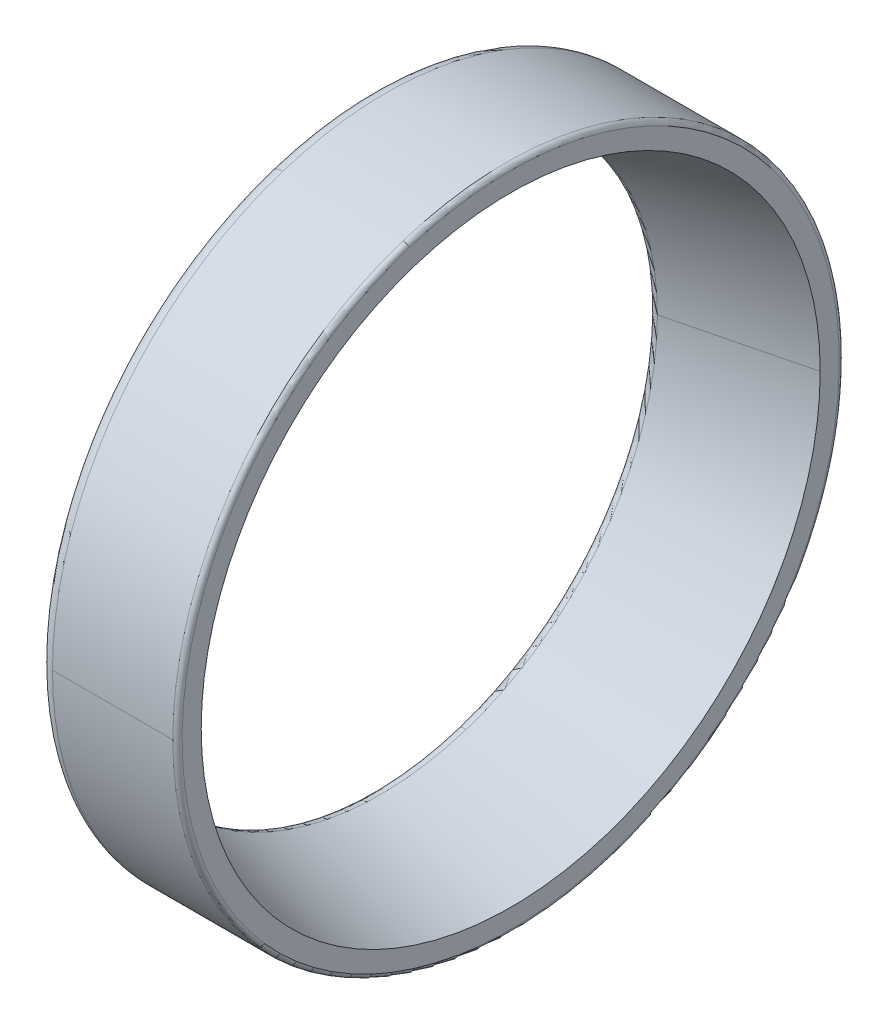
ISO-10303-21;
HEADER;
FILE_DESCRIPTION(('STEP AP214'),'2;1');
FILE_NAME('part.step','',(''),(''),'','','');
FILE_SCHEMA(('AUTOMOTIVE_DESIGN { 1 0 10303 214 1 1 1 1 }'));
ENDSEC;
DATA;
#1=APPLICATION_CONTEXT('core data for automotive mechanical design processes');
#2=APPLICATION_PROTOCOL_DEFINITION('international standard','automotive_design',2000,#1);
#3=PRODUCT_CONTEXT('',#1,'mechanical');
#4=PRODUCT('Part','Part','',(#3));
#5=PRODUCT_RELATED_PRODUCT_CATEGORY('part','',(#4));
#6=PRODUCT_DEFINITION_FORMATION('','',#4);
#7=PRODUCT_DEFINITION_CONTEXT('part definition',#1,'design');
#8=PRODUCT_DEFINITION('design','',#6,#7);
#9=PRODUCT_DEFINITION_SHAPE('','',#8);
#10=(LENGTH_UNIT() NAMED_UNIT(*) SI_UNIT(.MILLI.,.METRE.));
#11=(NAMED_UNIT(*) PLANE_ANGLE_UNIT() SI_UNIT($,.RADIAN.));
#12=(NAMED_UNIT(*) SI_UNIT($,.STERADIAN.) SOLID_ANGLE_UNIT());
#13=UNCERTAINTY_MEASURE_WITH_UNIT(LENGTH_MEASURE(1.E-05),#10,'distance_accuracy_value','');
#14=(GEOMETRIC_REPRESENTATION_CONTEXT(3) GLOBAL_UNCERTAINTY_ASSIGNED_CONTEXT((#13)) GLOBAL_UNIT_ASSIGNED_CONTEXT((#10,
#11,#12)) REPRESENTATION_CONTEXT('',''));
#15=CARTESIAN_POINT('',(0.,0.,0.));
#16=DIRECTION('',(0.,0.,1.));
#17=DIRECTION('',(1.,0.,0.));
#18=AXIS2_PLACEMENT_3D('',#15,#16,#17);
#19=CARTESIAN_POINT('',(0.,34.5,0.));
#20=DIRECTION('',(-1.,0.,0.));
#21=DIRECTION('',(0.,0.,1.));
#22=AXIS2_PLACEMENT_3D('',#19,#20,#21);
#23=PLANE('',#22);
#24=CARTESIAN_POINT('',(0.,0.,0.));
#25=DIRECTION('',(1.,0.,0.));
#26=DIRECTION('',(0.,0.,-1.));
#27=AXIS2_PLACEMENT_3D('',#24,#25,#26);
#28=CIRCLE('',#27,30.64260080616);
#29=CARTESIAN_POINT('',(0.,29.1428451729286,9.46908440095059));
#30=VERTEX_POINT('',#29);
#31=CARTESIAN_POINT('',(0.,-29.1428451729286,-9.46908440095059));
#32=VERTEX_POINT('',#31);
#33=EDGE_CURVE('E11',#30,#32,#28,.T.);
#34=ORIENTED_EDGE('',*,*,#33,.T.);
#35=CARTESIAN_POINT('',(0.,-29.1428451729296,-9.4690844009509));
#36=CARTESIAN_POINT('',(0.,-27.6553844609523,-14.0467889832671));
#37=CARTESIAN_POINT('',(0.,-25.2694637617286,-18.3327089530953));
#38=CARTESIAN_POINT('',(0.,-22.05991163477,-22.0904091483767));
#39=CARTESIAN_POINT('',(0.,-14.3404293681213,-28.1446665935469));
#40=CARTESIAN_POINT('',(0.,-4.9050282422195,-30.8312866100828));
#41=CARTESIAN_POINT('',(0.,0.0215661764424724,-31.2190264007923));
#42=CARTESIAN_POINT('',(0.,9.76106776064583,-30.0414775521919));
#43=CARTESIAN_POINT('',(0.,18.3326359060695,-25.2693991865423));
#44=CARTESIAN_POINT('',(0.,22.0904267844536,-22.059931563147));
#45=CARTESIAN_POINT('',(0.,28.1446710198193,-14.3404206810727));
#46=CARTESIAN_POINT('',(0.,30.831260121461,-4.90502568793965));
#47=CARTESIAN_POINT('',(0.,31.21912157918,0.0215450364993295));
#48=CARTESIAN_POINT('',(0.,30.630171421312,4.89133612876434));
#49=CARTESIAN_POINT('',(0.,29.1428451729296,9.46908440095089));
#50=B_SPLINE_CURVE_WITH_KNOTS('',5,(#35,#36,#37,#38,#39,#40,#41,#42,#43,#44,#45,#46,#47,#48,
#49),.UNSPECIFIED.,.F.,.F.,(6,3,3,3,6),(0.,0.785398163397448,1.5707963267949,2.35619449019234,
3.14159265358979),.UNSPECIFIED.);
#51=EDGE_CURVE('E25',#32,#30,#50,.T.);
#52=ORIENTED_EDGE('',*,*,#51,.T.);
#53=EDGE_LOOP('',(#34,#52));
#54=FACE_BOUND('',#53,.T.);
#55=CARTESIAN_POINT('',(0.,32.8114498121828,10.6610863059358));
#56=CARTESIAN_POINT('',(0.,32.6370194077504,11.1979666405393));
#57=CARTESIAN_POINT('',(0.,32.4493900248656,11.7305572957197));
#58=CARTESIAN_POINT('',(0.,32.0482345212866,12.7858948926291));
#59=CARTESIAN_POINT('',(0.,31.8347084005924,13.308641834358));
#60=CARTESIAN_POINT('',(0.,31.3822606404899,14.3430276497588));
#61=CARTESIAN_POINT('',(0.,31.1433390010817,14.8546665234307));
#62=CARTESIAN_POINT('',(0.,30.6406793193583,15.8656049626667));
#63=CARTESIAN_POINT('',(0.,30.3769412770432,16.3649045282308));
#64=CARTESIAN_POINT('',(0.,29.8252832109797,17.3499611350593));
#65=CARTESIAN_POINT('',(0.,29.5373631872314,17.8357181763237));
#66=CARTESIAN_POINT('',(0.,28.9380350364906,18.7925195997026));
#67=CARTESIAN_POINT('',(0.,28.6266269094981,19.2635639818171));
#68=CARTESIAN_POINT('',(0.,27.9810726937622,20.1898052738883));
#69=CARTESIAN_POINT('',(0.,27.6469266050188,20.6450021838449));
#70=CARTESIAN_POINT('',(0.,26.9567014711866,21.5384519292956));
#71=CARTESIAN_POINT('',(0.,26.6006224260979,21.9767047647896));
#72=CARTESIAN_POINT('',(0.,25.8673892003041,22.8352105699932));
#73=CARTESIAN_POINT('',(0.,25.4902350195991,23.2554635397028));
#74=CARTESIAN_POINT('',(0.,24.7157601213364,24.0769571876206));
#75=CARTESIAN_POINT('',(0.,24.3184394037787,24.4781978658289));
#76=CARTESIAN_POINT('',(0.,23.5045886118701,25.2607003066726));
#77=CARTESIAN_POINT('',(0.,23.0880585375191,25.6419620693081));
#78=CARTESIAN_POINT('',(0.,22.2367924895506,26.3835881860611));
#79=CARTESIAN_POINT('',(0.,21.8020565159331,26.7439525401786));
#80=CARTESIAN_POINT('',(0.,20.9154259864453,27.4429156905929));
#81=CARTESIAN_POINT('',(0.,20.4635314305749,27.7815144868897));
#82=CARTESIAN_POINT('',(0.,19.5436723901544,28.4361308075071));
#83=CARTESIAN_POINT('',(0.,19.0757079056043,28.7521483318277));
#84=CARTESIAN_POINT('',(0.,18.1248363752546,29.3608407945961));
#85=CARTESIAN_POINT('',(0.,17.641929329455,29.6535157330439));
#86=CARTESIAN_POINT('',(0.,16.662336041978,30.2148179445047));
#87=CARTESIAN_POINT('',(0.,16.1656498003005,30.4834452175178));
#88=CARTESIAN_POINT('',(0.,15.1596946817281,30.9960049514796));
#89=CARTESIAN_POINT('',(0.,14.6504258048333,31.2399374124283));
#90=CARTESIAN_POINT('',(0.,13.6205322891575,31.702519867597));
#91=CARTESIAN_POINT('',(0.,13.0999076503766,31.9211698618169));
#92=CARTESIAN_POINT('',(0.,12.0485568412846,32.3326606365405));
#93=CARTESIAN_POINT('',(0.,11.5178306709737,32.5255014170442));
#94=CARTESIAN_POINT('',(0.,10.4475553646521,32.8849091940041));
#95=CARTESIAN_POINT('',(0.,9.90800622864158,33.0514761904603));
#96=CARTESIAN_POINT('',(0.,8.82138481204843,33.3579351248414));
#97=CARTESIAN_POINT('',(0.,8.27431253146584,33.4978270627662));
#98=CARTESIAN_POINT('',(0.,7.17396277077043,33.7505988681529));
#99=CARTESIAN_POINT('',(0.,6.62068529065761,33.8634787356148));
#100=CARTESIAN_POINT('',(0.,5.50925802481272,34.0619544625878));
#101=CARTESIAN_POINT('',(0.,4.95110823908065,34.1475503220988));
#102=CARTESIAN_POINT('',(0.,3.83128099371924,34.2912518252474));
#103=CARTESIAN_POINT('',(0.,3.26960353408989,34.3493574688848));
#104=CARTESIAN_POINT('',(0.,2.1440740711313,34.437938558701));
#105=CARTESIAN_POINT('',(0.,1.58022206780205,34.4684140048798));
#106=CARTESIAN_POINT('',(0.,0.451701886307285,34.5016612817596));
#107=CARTESIAN_POINT('',(0.,-0.112966291858231,34.5044331124606));
#108=CARTESIAN_POINT('',(0.,-1.24175848792524,34.4822664808019));
#109=CARTESIAN_POINT('',(0.,-1.80588250582674,34.4573280184421));
#110=CARTESIAN_POINT('',(0.,-2.93222735719516,34.379800879602));
#111=CARTESIAN_POINT('',(0.,-3.49444819066209,34.3272122031217));
#112=CARTESIAN_POINT('',(0.,-4.61563223392882,34.1945113267683));
#113=CARTESIAN_POINT('',(0.,-5.17459544372863,34.1143991268952));
#114=CARTESIAN_POINT('',(0.,-6.28791764832931,33.9268442010629));
#115=CARTESIAN_POINT('',(0.,-6.84227664313019,33.8194014751036));
#116=CARTESIAN_POINT('',(0.,-7.94505491835844,33.5774443360366));
#117=CARTESIAN_POINT('',(0.,-8.4934741987858,33.4429299229288));
#118=CARTESIAN_POINT('',(0.,-9.58305185518461,33.147153466568));
#119=CARTESIAN_POINT('',(0.,-10.1242102311561,32.9858914233149));
#120=CARTESIAN_POINT('',(0.,-11.1979623807154,32.6370082010506));
#121=CARTESIAN_POINT('',(0.,-11.7305561543034,32.4493870220394));
#122=CARTESIAN_POINT('',(0.,-12.7858960340455,32.0482375241127));
#123=CARTESIAN_POINT('',(0.,-13.3086421401996,31.8347092051972));
#124=CARTESIAN_POINT('',(0.,-14.3430273439172,31.3822598358851));
#125=CARTESIAN_POINT('',(0.,-14.8546664414807,31.1433387854885));
#126=CARTESIAN_POINT('',(0.,-15.8656050446167,30.6406795349516));
#127=CARTESIAN_POINT('',(0.,-16.3649045501892,30.3769413348112));
#128=CARTESIAN_POINT('',(0.,-17.3499611131008,29.8252831532117));
#129=CARTESIAN_POINT('',(0.,-17.8357181704399,29.5373631717526));
#130=CARTESIAN_POINT('',(0.,-18.7925196055863,28.9380350519696));
#131=CARTESIAN_POINT('',(0.,-19.2635639833936,28.6266269136457));
#132=CARTESIAN_POINT('',(0.,-20.1898052723117,27.9810726896147));
#133=CARTESIAN_POINT('',(0.,-20.6450021834224,27.6469266039075));
#134=CARTESIAN_POINT('',(0.,-21.538451929718,26.956701472298));
#135=CARTESIAN_POINT('',(0.,-21.9767047649028,26.6006224263957));
#136=CARTESIAN_POINT('',(0.,-22.83521056988,25.8673892000064));
#137=CARTESIAN_POINT('',(0.,-23.2554635396724,25.4902350195194));
#138=CARTESIAN_POINT('',(0.,-24.0769571876509,24.7157601214162));
#139=CARTESIAN_POINT('',(0.,-24.478197865837,24.3184394038001));
#140=CARTESIAN_POINT('',(0.,-25.2607003066645,23.5045886118487));
#141=CARTESIAN_POINT('',(0.,-25.6419620693059,23.0880585375134));
#142=CARTESIAN_POINT('',(0.,-26.3835881860632,22.2367924895564));
#143=CARTESIAN_POINT('',(0.,-26.7439525401791,21.8020565159347));
#144=CARTESIAN_POINT('',(0.,-27.4429156905923,20.9154259864438));
#145=CARTESIAN_POINT('',(0.,-27.7815144868896,20.4635314305745));
#146=CARTESIAN_POINT('',(0.,-28.4361308075073,19.5436723901549));
#147=CARTESIAN_POINT('',(0.,-28.7521483318278,19.0757079056044));
#148=CARTESIAN_POINT('',(0.,-29.3608407945961,18.1248363752545));
#149=CARTESIAN_POINT('',(0.,-29.6535157330438,17.6419293294551));
#150=CARTESIAN_POINT('',(0.,-30.2148179445047,16.6623360419781));
#151=CARTESIAN_POINT('',(0.,-30.4834452175178,16.1656498003005));
#152=CARTESIAN_POINT('',(0.,-30.9960049514796,15.1596946817282));
#153=CARTESIAN_POINT('',(0.,-31.2399374124283,14.6504258048334));
#154=CARTESIAN_POINT('',(0.,-31.702519867597,13.6205322891576));
#155=CARTESIAN_POINT('',(0.,-31.9211698618171,13.0999076503766));
#156=CARTESIAN_POINT('',(0.,-32.3326606365404,12.0485568412847));
#157=CARTESIAN_POINT('',(0.,-32.5255014170437,11.5178306709738));
#158=CARTESIAN_POINT('',(0.,-32.8849091940045,10.4475553646521));
#159=CARTESIAN_POINT('',(0.,-33.0514761904619,9.90800622864118));
#160=CARTESIAN_POINT('',(0.,-33.3579351248398,8.82138481204889));
#161=CARTESIAN_POINT('',(0.,-33.4978270627603,8.27431253146748));
#162=CARTESIAN_POINT('',(0.,-33.7505988681588,7.17396277076887));
#163=CARTESIAN_POINT('',(0.,-33.8634787356369,6.62068529065166));
#164=CARTESIAN_POINT('',(0.,-34.0619544625657,5.50925802481875));
#165=CARTESIAN_POINT('',(0.,-34.1475503220165,4.95110823910304));
#166=CARTESIAN_POINT('',(0.,-34.2912518253298,3.83128099369689));
#167=CARTESIAN_POINT('',(0.,-34.3493574691922,3.26960353400645));
#168=CARTESIAN_POINT('',(0.,-34.4379385583936,2.14407407121478));
#169=CARTESIAN_POINT('',(0.,-34.4684140037325,1.58022206811355));
#170=CARTESIAN_POINT('',(0.,-34.501661282907,0.451701885995848));
#171=CARTESIAN_POINT('',(0.,-34.5044331167427,-0.112966293020619));
#172=CARTESIAN_POINT('',(0.,-34.4822664765197,-1.24175848676279));
#173=CARTESIAN_POINT('',(0.,-34.457328002461,-1.80588250148849));
#174=CARTESIAN_POINT('',(0.,-34.3798008955831,-2.93222736153335));
#175=CARTESIAN_POINT('',(0.,-34.3272122627638,-3.49444820685252));
#176=CARTESIAN_POINT('',(0.,-34.1945112671261,-4.61563221773836));
#177=CARTESIAN_POINT('',(0.,-34.1143989043076,-5.17459538330505));
#178=CARTESIAN_POINT('',(0.,-33.9268444236505,-6.28791770875285));
#179=CARTESIAN_POINT('',(0.,-33.8194023058118,-6.84227686863398));
#180=CARTESIAN_POINT('',(0.,-33.5774435053284,-7.94505469285459));
#181=CARTESIAN_POINT('',(0.,-33.4429268226837,-8.49347335719408));
#182=CARTESIAN_POINT('',(0.,-33.147156566813,-9.58305269677627));
#183=CARTESIAN_POINT('',(0.,-32.9859029935871,-10.124213372019));
#184=CARTESIAN_POINT('',(0.,-32.8114498121828,-10.6610863059357));
#185=B_SPLINE_CURVE_WITH_KNOTS('',3,(#55,#56,#57,#58,#59,#60,#61,#62,#63,#64,#65,#66,#67,#68,
#69,#70,#71,#72,#73,#74,#75,#76,#77,#78,#79,#80,#81,#82,#83,#84,#85,#86,#87,#88,#89,#90,#91,#92,
#93,#94,#95,#96,#97,#98,#99,#100,#101,#102,#103,#104,#105,#106,#107,#108,#109,#110,#111,#112,
#113,#114,#115,#116,#117,#118,#119,#120,#121,#122,#123,#124,#125,#126,#127,#128,#129,#130,#131,
#132,#133,#134,#135,#136,#137,#138,#139,#140,#141,#142,#143,#144,#145,#146,#147,#148,#149,#150,
#151,#152,#153,#154,#155,#156,#157,#158,#159,#160,#161,#162,#163,#164,#165,#166,#167,#168,#169,
#170,#171,#172,#173,#174,#175,#176,#177,#178,#179,#180,#181,#182,#183,#184),.UNSPECIFIED.,.F.,
.F.,(4,2,2,2,2,2,2,2,2,2,2,2,2,2,2,2,2,2,2,2,2,2,2,2,2,2,2,2,2,2,2,2,2,2,2,2,2,2,2,2,2,2,2,2,2,
2,2,2,2,2,2,2,2,2,2,2,2,2,2,2,2,2,2,2,4),(0.,1.69334476808094,3.38668953616189,5.08003430424284,
6.77337907232379,8.46672384040474,10.1600686084857,11.8534133765666,13.5467581446476,
15.2401029127285,16.9334476808095,18.6267924488904,20.3201372169714,22.0134819850523,
23.7068267531333,25.4001715212142,27.0935162892952,28.7868610573761,30.4802058254571,
32.173550593538,33.8668953616189,35.5602401296999,37.2535848977808,38.9469296658618,
40.6402744339427,42.3336192020237,44.0269639701046,45.7203087381856,47.4136535062665,
49.1069982743475,50.8003430424284,52.4936878105094,54.1870325785903,55.8803773466713,
57.5737221147522,59.2670668828332,60.9604116509141,62.6537564189951,64.347101187076,
66.040445955157,67.7337907232379,69.4271354913189,71.1204802593998,72.8138250274808,
74.5071697955617,76.2005145636427,77.8938593317236,79.5872040998046,81.2805488678855,
82.9738936359664,84.6672384040474,86.3605831721283,88.0539279402093,89.7472727082902,
91.4406174763712,93.1339622444521,94.8273070125331,96.520651780614,98.213996548695,
99.9073413167759,101.600686084857,103.294030852938,104.987375621019,106.6807203891,
108.374065157181),.UNSPECIFIED.);
#186=CARTESIAN_POINT('',(0.,32.8114498121828,10.6610863059357));
#187=VERTEX_POINT('',#186);
#188=CARTESIAN_POINT('',(0.,-32.8114498121828,-10.6610863059357));
#189=VERTEX_POINT('',#188);
#190=EDGE_CURVE('E199',#187,#189,#185,.T.);
#191=ORIENTED_EDGE('',*,*,#190,.F.);
#192=CARTESIAN_POINT('',(0.,-32.8114498121828,-10.6610863059358));
#193=CARTESIAN_POINT('',(0.,-32.6370194077504,-11.1979666405393));
#194=CARTESIAN_POINT('',(0.,-32.4493900248656,-11.7305572957197));
#195=CARTESIAN_POINT('',(0.,-32.0482345212866,-12.7858948926291));
#196=CARTESIAN_POINT('',(0.,-31.8347084005924,-13.308641834358));
#197=CARTESIAN_POINT('',(0.,-31.3822606404899,-14.3430276497588));
#198=CARTESIAN_POINT('',(0.,-31.1433390010817,-14.8546665234307));
#199=CARTESIAN_POINT('',(0.,-30.6406793193583,-15.8656049626667));
#200=CARTESIAN_POINT('',(0.,-30.3769412770432,-16.3649045282308));
#201=CARTESIAN_POINT('',(0.,-29.8252832109797,-17.3499611350593));
#202=CARTESIAN_POINT('',(0.,-29.5373631872315,-17.8357181763237));
#203=CARTESIAN_POINT('',(0.,-28.9380350364906,-18.7925195997026));
#204=CARTESIAN_POINT('',(0.,-28.6266269094981,-19.2635639818171));
#205=CARTESIAN_POINT('',(0.,-27.9810726937622,-20.1898052738883));
#206=CARTESIAN_POINT('',(0.,-27.6469266050188,-20.6450021838449));
#207=CARTESIAN_POINT('',(0.,-26.9567014711867,-21.5384519292956));
#208=CARTESIAN_POINT('',(0.,-26.6006224260979,-21.9767047647896));
#209=CARTESIAN_POINT('',(0.,-25.8673892003041,-22.8352105699932));
#210=CARTESIAN_POINT('',(0.,-25.4902350195991,-23.2554635397028));
#211=CARTESIAN_POINT('',(0.,-24.7157601213364,-24.0769571876206));
#212=CARTESIAN_POINT('',(0.,-24.3184394037787,-24.4781978658289));
#213=CARTESIAN_POINT('',(0.,-23.5045886118701,-25.2607003066726));
#214=CARTESIAN_POINT('',(0.,-23.0880585375191,-25.641962069308));
#215=CARTESIAN_POINT('',(0.,-22.2367924895507,-26.383588186061));
#216=CARTESIAN_POINT('',(0.,-21.8020565159332,-26.7439525401786));
#217=CARTESIAN_POINT('',(0.,-20.9154259864453,-27.4429156905929));
#218=CARTESIAN_POINT('',(0.,-20.4635314305749,-27.7815144868897));
#219=CARTESIAN_POINT('',(0.,-19.5436723901544,-28.4361308075071));
#220=CARTESIAN_POINT('',(0.,-19.0757079056043,-28.7521483318277));
#221=CARTESIAN_POINT('',(0.,-18.1248363752546,-29.3608407945961));
#222=CARTESIAN_POINT('',(0.,-17.6419293294551,-29.6535157330439));
#223=CARTESIAN_POINT('',(0.,-16.662336041978,-30.2148179445047));
#224=CARTESIAN_POINT('',(0.,-16.1656498003005,-30.4834452175178));
#225=CARTESIAN_POINT('',(0.,-15.1596946817282,-30.9960049514796));
#226=CARTESIAN_POINT('',(0.,-14.6504258048334,-31.2399374124283));
#227=CARTESIAN_POINT('',(0.,-13.6205322891576,-31.702519867597));
#228=CARTESIAN_POINT('',(0.,-13.0999076503766,-31.9211698618169));
#229=CARTESIAN_POINT('',(0.,-12.0485568412847,-32.3326606365405));
#230=CARTESIAN_POINT('',(0.,-11.5178306709737,-32.5255014170442));
#231=CARTESIAN_POINT('',(0.,-10.4475553646522,-32.8849091940041));
#232=CARTESIAN_POINT('',(0.,-9.90800622864161,-33.0514761904603));
#233=CARTESIAN_POINT('',(0.,-8.82138481204846,-33.3579351248414));
#234=CARTESIAN_POINT('',(0.,-8.27431253146587,-33.4978270627662));
#235=CARTESIAN_POINT('',(0.,-7.17396277077047,-33.7505988681529));
#236=CARTESIAN_POINT('',(0.,-6.62068529065766,-33.8634787356148));
#237=CARTESIAN_POINT('',(0.,-5.50925802481277,-34.0619544625877));
#238=CARTESIAN_POINT('',(0.,-4.9511082390807,-34.1475503220988));
#239=CARTESIAN_POINT('',(0.,-3.83128099371929,-34.2912518252474));
#240=CARTESIAN_POINT('',(0.,-3.26960353408994,-34.3493574688848));
#241=CARTESIAN_POINT('',(0.,-2.14407407113134,-34.437938558701));
#242=CARTESIAN_POINT('',(0.,-1.58022206780209,-34.4684140048798));
#243=CARTESIAN_POINT('',(0.,-0.451701886307324,-34.5016612817596));
#244=CARTESIAN_POINT('',(0.,0.112966291858186,-34.5044331124606));
#245=CARTESIAN_POINT('',(0.,1.24175848792519,-34.4822664808019));
#246=CARTESIAN_POINT('',(0.,1.80588250582669,-34.4573280184421));
#247=CARTESIAN_POINT('',(0.,2.93222735719511,-34.379800879602));
#248=CARTESIAN_POINT('',(0.,3.49444819066203,-34.3272122031217));
#249=CARTESIAN_POINT('',(0.,4.61563223392876,-34.1945113267683));
#250=CARTESIAN_POINT('',(0.,5.17459544372856,-34.1143991268952));
#251=CARTESIAN_POINT('',(0.,6.28791764832925,-33.9268442010629));
#252=CARTESIAN_POINT('',(0.,6.84227664313013,-33.8194014751036));
#253=CARTESIAN_POINT('',(0.,7.94505491835837,-33.5774443360366));
#254=CARTESIAN_POINT('',(0.,8.49347419878574,-33.4429299229288));
#255=CARTESIAN_POINT('',(0.,9.58305185518454,-33.147153466568));
#256=CARTESIAN_POINT('',(0.,10.124210231156,-32.9858914233149));
#257=CARTESIAN_POINT('',(0.,11.1979623807154,-32.6370082010507));
#258=CARTESIAN_POINT('',(0.,11.7305561543033,-32.4493870220395));
#259=CARTESIAN_POINT('',(0.,12.7858960340454,-32.0482375241127));
#260=CARTESIAN_POINT('',(0.,13.3086421401995,-31.8347092051972));
#261=CARTESIAN_POINT('',(0.,14.3430273439172,-31.3822598358851));
#262=CARTESIAN_POINT('',(0.,14.8546664414807,-31.1433387854885));
#263=CARTESIAN_POINT('',(0.,15.8656050446166,-30.6406795349516));
#264=CARTESIAN_POINT('',(0.,16.3649045501891,-30.3769413348113));
#265=CARTESIAN_POINT('',(0.,17.3499611131007,-29.8252831532118));
#266=CARTESIAN_POINT('',(0.,17.8357181704398,-29.5373631717526));
#267=CARTESIAN_POINT('',(0.,18.7925196055863,-28.9380350519696));
#268=CARTESIAN_POINT('',(0.,19.2635639833936,-28.6266269136458));
#269=CARTESIAN_POINT('',(0.,20.1898052723116,-27.9810726896147));
#270=CARTESIAN_POINT('',(0.,20.6450021834224,-27.6469266039075));
#271=CARTESIAN_POINT('',(0.,21.5384519297179,-26.9567014722981));
#272=CARTESIAN_POINT('',(0.,21.9767047649027,-26.6006224263957));
#273=CARTESIAN_POINT('',(0.,22.8352105698799,-25.8673892000064));
#274=CARTESIAN_POINT('',(0.,23.2554635396724,-25.4902350195194));
#275=CARTESIAN_POINT('',(0.,24.0769571876509,-24.7157601214163));
#276=CARTESIAN_POINT('',(0.,24.4781978658369,-24.3184394038002));
#277=CARTESIAN_POINT('',(0.,25.2607003066644,-23.5045886118488));
#278=CARTESIAN_POINT('',(0.,25.6419620693058,-23.0880585375135));
#279=CARTESIAN_POINT('',(0.,26.3835881860631,-22.2367924895565));
#280=CARTESIAN_POINT('',(0.,26.7439525401791,-21.8020565159348));
#281=CARTESIAN_POINT('',(0.,27.4429156905923,-20.9154259864438));
#282=CARTESIAN_POINT('',(0.,27.7815144868895,-20.4635314305746));
#283=CARTESIAN_POINT('',(0.,28.4361308075072,-19.5436723901549));
#284=CARTESIAN_POINT('',(0.,28.7521483318277,-19.0757079056045));
#285=CARTESIAN_POINT('',(0.,29.360840794596,-18.1248363752546));
#286=CARTESIAN_POINT('',(0.,29.6535157330438,-17.6419293294551));
#287=CARTESIAN_POINT('',(0.,30.2148179445047,-16.6623360419781));
#288=CARTESIAN_POINT('',(0.,30.4834452175178,-16.1656498003006));
#289=CARTESIAN_POINT('',(0.,30.9960049514796,-15.1596946817283));
#290=CARTESIAN_POINT('',(0.,31.2399374124283,-14.6504258048334));
#291=CARTESIAN_POINT('',(0.,31.702519867597,-13.6205322891576));
#292=CARTESIAN_POINT('',(0.,31.921169861817,-13.0999076503766));
#293=CARTESIAN_POINT('',(0.,32.3326606365404,-12.0485568412848));
#294=CARTESIAN_POINT('',(0.,32.5255014170437,-11.5178306709739));
#295=CARTESIAN_POINT('',(0.,32.8849091940045,-10.4475553646521));
#296=CARTESIAN_POINT('',(0.,33.0514761904619,-9.90800622864127));
#297=CARTESIAN_POINT('',(0.,33.3579351248398,-8.82138481204898));
#298=CARTESIAN_POINT('',(0.,33.4978270627603,-8.27431253146757));
#299=CARTESIAN_POINT('',(0.,33.7505988681588,-7.17396277076896));
#300=CARTESIAN_POINT('',(0.,33.8634787356368,-6.62068529065176));
#301=CARTESIAN_POINT('',(0.,34.0619544625657,-5.50925802481886));
#302=CARTESIAN_POINT('',(0.,34.1475503220164,-4.95110823910316));
#303=CARTESIAN_POINT('',(0.,34.2912518253297,-3.83128099369702));
#304=CARTESIAN_POINT('',(0.,34.3493574691922,-3.26960353400658));
#305=CARTESIAN_POINT('',(0.,34.4379385583936,-2.1440740712149));
#306=CARTESIAN_POINT('',(0.,34.4684140037324,-1.58022206811367));
#307=CARTESIAN_POINT('',(0.,34.501661282907,-0.451701885995974));
#308=CARTESIAN_POINT('',(0.,34.5044331167427,0.112966293020492));
#309=CARTESIAN_POINT('',(0.,34.4822664765197,1.24175848676266));
#310=CARTESIAN_POINT('',(0.,34.457328002461,1.80588250148836));
#311=CARTESIAN_POINT('',(0.,34.3798008955831,2.93222736153323));
#312=CARTESIAN_POINT('',(0.,34.3272122627638,3.49444820685239));
#313=CARTESIAN_POINT('',(0.,34.1945112671261,4.61563221773824));
#314=CARTESIAN_POINT('',(0.,34.1143989043076,5.17459538330492));
#315=CARTESIAN_POINT('',(0.,33.9268444236505,6.28791770875273));
#316=CARTESIAN_POINT('',(0.,33.8194023058118,6.84227686863386));
#317=CARTESIAN_POINT('',(0.,33.5774435053284,7.94505469285447));
#318=CARTESIAN_POINT('',(0.,33.4429268226838,8.49347335719395));
#319=CARTESIAN_POINT('',(0.,33.1471565668131,9.58305269677614));
#320=CARTESIAN_POINT('',(0.,32.9859029935871,10.1242133720188));
#321=CARTESIAN_POINT('',(0.,32.8114498121828,10.6610863059356));
#322=B_SPLINE_CURVE_WITH_KNOTS('',3,(#192,#193,#194,#195,#196,#197,#198,#199,#200,#201,#202,
#203,#204,#205,#206,#207,#208,#209,#210,#211,#212,#213,#214,#215,#216,#217,#218,#219,#220,#221,
#222,#223,#224,#225,#226,#227,#228,#229,#230,#231,#232,#233,#234,#235,#236,#237,#238,#239,#240,
#241,#242,#243,#244,#245,#246,#247,#248,#249,#250,#251,#252,#253,#254,#255,#256,#257,#258,#259,
#260,#261,#262,#263,#264,#265,#266,#267,#268,#269,#270,#271,#272,#273,#274,#275,#276,#277,#278,
#279,#280,#281,#282,#283,#284,#285,#286,#287,#288,#289,#290,#291,#292,#293,#294,#295,#296,#297,
#298,#299,#300,#301,#302,#303,#304,#305,#306,#307,#308,#309,#310,#311,#312,#313,#314,#315,#316,
#317,#318,#319,#320,#321),.UNSPECIFIED.,.F.,.F.,(4,2,2,2,2,2,2,2,2,2,2,2,2,2,2,2,2,2,2,2,2,2,2,
2,2,2,2,2,2,2,2,2,2,2,2,2,2,2,2,2,2,2,2,2,2,2,2,2,2,2,2,2,2,2,2,2,2,2,2,2,2,2,2,2,4),(0.,
1.69334476808094,3.38668953616189,5.08003430424283,6.77337907232379,8.46672384040473,
10.1600686084857,11.8534133765666,13.5467581446476,15.2401029127285,16.9334476808095,
18.6267924488904,20.3201372169713,22.0134819850523,23.7068267531332,25.4001715212142,
27.0935162892951,28.7868610573761,30.480205825457,32.173550593538,33.8668953616189,
35.5602401296998,37.2535848977808,38.9469296658617,40.6402744339427,42.3336192020236,
44.0269639701046,45.7203087381855,47.4136535062665,49.1069982743474,50.8003430424284,
52.4936878105093,54.1870325785902,55.8803773466712,57.5737221147521,59.2670668828331,
60.960411650914,62.653756418995,64.3471011870759,66.0404459551569,67.7337907232378,
69.4271354913188,71.1204802593997,72.8138250274806,74.5071697955616,76.2005145636425,
77.8938593317235,79.5872040998044,81.2805488678854,82.9738936359663,84.6672384040473,
86.3605831721282,88.0539279402091,89.7472727082901,91.440617476371,93.133962244452,
94.8273070125329,96.5206517806139,98.2139965486948,99.9073413167758,101.600686084857,
103.294030852938,104.987375621019,106.6807203891,108.374065157181),.UNSPECIFIED.);
#323=EDGE_CURVE('E300',#189,#187,#322,.T.);
#324=ORIENTED_EDGE('',*,*,#323,.F.);
#325=EDGE_LOOP('',(#191,#324));
#326=FACE_BOUND('',#325,.T.);
#327=ADVANCED_FACE('F16',(#54,#326),#23,.T.);
#328=CARTESIAN_POINT('',(1.4999999999997,0.,0.));
#329=DIRECTION('',(1.,0.,0.));
#330=DIRECTION('',(0.,-0.309016994374947,0.951056516295154));
#331=AXIS2_PLACEMENT_3D('',#328,#329,#330);
#332=TOROIDAL_SURFACE('',#331,34.5,1.4999999999997);
#333=CARTESIAN_POINT('',(1.4999999999997,-32.8114498121828,-10.6610863059357));
#334=DIRECTION('',(0.,0.309016994374948,-0.951056516295153));
#335=DIRECTION('',(1.97471668646701E-13,-0.951056516295153,-0.309016994374948));
#336=AXIS2_PLACEMENT_3D('',#333,#334,#335);
#337=CIRCLE('',#336,1.49999999999969);
#338=CARTESIAN_POINT('',(1.5,-34.2380345866252,-11.124611797498));
#339=VERTEX_POINT('',#338);
#340=EDGE_CURVE('E263',#339,#189,#337,.T.);
#341=ORIENTED_EDGE('',*,*,#340,.T.);
#342=ORIENTED_EDGE('',*,*,#323,.T.);
#343=CARTESIAN_POINT('',(1.4999999999997,32.8114498121828,10.6610863059357));
#344=DIRECTION('',(0.,-0.309016994374948,0.951056516295153));
#345=DIRECTION('',(1.99248025486102E-13,0.951056516295153,0.309016994374948));
#346=AXIS2_PLACEMENT_3D('',#343,#344,#345);
#347=CIRCLE('',#346,1.49999999999969);
#348=CARTESIAN_POINT('',(1.5,34.2380345866252,11.124611797498));
#349=VERTEX_POINT('',#348);
#350=EDGE_CURVE('E259',#349,#187,#347,.T.);
#351=ORIENTED_EDGE('',*,*,#350,.F.);
#352=CARTESIAN_POINT('',(1.5,0.,0.));
#353=DIRECTION('',(1.,0.,0.));
#354=DIRECTION('',(0.,0.,-1.));
#355=AXIS2_PLACEMENT_3D('',#352,#353,#354);
#356=CIRCLE('',#355,36.);
#357=CARTESIAN_POINT('',(1.5,0.,-36.));
#358=VERTEX_POINT('',#357);
#359=EDGE_CURVE('E254',#358,#349,#356,.T.);
#360=ORIENTED_EDGE('',*,*,#359,.F.);
#361=CARTESIAN_POINT('',(1.5,0.,0.));
#362=DIRECTION('',(1.,0.,0.));
#363=DIRECTION('',(0.,0.,-1.));
#364=AXIS2_PLACEMENT_3D('',#361,#362,#363);
#365=CIRCLE('',#364,36.);
#366=EDGE_CURVE('E249',#339,#358,#365,.T.);
#367=ORIENTED_EDGE('',*,*,#366,.F.);
#368=EDGE_LOOP('',(#341,#342,#351,#360,#367));
#369=FACE_BOUND('',#368,.T.);
#370=ADVANCED_FACE('F271',(#369),#332,.T.);
#371=CARTESIAN_POINT('',(15.,0.,0.));
#372=DIRECTION('',(1.,0.,0.));
#373=DIRECTION('',(0.,1.,0.));
#374=AXIS2_PLACEMENT_3D('',#371,#372,#373);
#375=CYLINDRICAL_SURFACE('',#374,36.);
#376=DIRECTION('',(1.,0.,0.));
#377=VECTOR('',#376,1.);
#378=CARTESIAN_POINT('',(1.5,0.,36.));
#379=LINE('',#378,#377);
#380=CARTESIAN_POINT('',(1.5,0.,36.));
#381=VERTEX_POINT('',#380);
#382=CARTESIAN_POINT('',(14.5,0.,36.));
#383=VERTEX_POINT('',#382);
#384=EDGE_CURVE('E244',#381,#383,#379,.T.);
#385=ORIENTED_EDGE('',*,*,#384,.F.);
#386=CARTESIAN_POINT('',(1.5,0.,0.));
#387=DIRECTION('',(1.,0.,0.));
#388=DIRECTION('',(0.,0.,-1.));
#389=AXIS2_PLACEMENT_3D('',#386,#387,#388);
#390=CIRCLE('',#389,36.);
#391=EDGE_CURVE('E239',#381,#339,#390,.T.);
#392=ORIENTED_EDGE('',*,*,#391,.T.);
#393=ORIENTED_EDGE('',*,*,#366,.T.);
#394=DIRECTION('',(1.,0.,0.));
#395=VECTOR('',#394,1.);
#396=CARTESIAN_POINT('',(1.5,0.,-36.));
#397=LINE('',#396,#395);
#398=CARTESIAN_POINT('',(14.5,0.,-36.));
#399=VERTEX_POINT('',#398);
#400=EDGE_CURVE('E235',#358,#399,#397,.T.);
#401=ORIENTED_EDGE('',*,*,#400,.T.);
#402=CARTESIAN_POINT('',(14.5,0.,0.));
#403=DIRECTION('',(1.,0.,0.));
#404=DIRECTION('',(0.,0.,-1.));
#405=AXIS2_PLACEMENT_3D('',#402,#403,#404);
#406=CIRCLE('',#405,36.);
#407=CARTESIAN_POINT('',(14.5,-34.2380345866255,-11.1246117974981));
#408=VERTEX_POINT('',#407);
#409=EDGE_CURVE('E230',#408,#399,#406,.T.);
#410=ORIENTED_EDGE('',*,*,#409,.F.);
#411=CARTESIAN_POINT('',(14.5,0.,0.));
#412=DIRECTION('',(1.,0.,0.));
#413=DIRECTION('',(0.,0.,-1.));
#414=AXIS2_PLACEMENT_3D('',#411,#412,#413);
#415=CIRCLE('',#414,36.);
#416=EDGE_CURVE('E225',#383,#408,#415,.T.);
#417=ORIENTED_EDGE('',*,*,#416,.F.);
#418=EDGE_LOOP('',(#385,#392,#393,#401,#410,#417));
#419=FACE_BOUND('',#418,.T.);
#420=ADVANCED_FACE('F280',(#419),#375,.T.);
#421=CARTESIAN_POINT('',(14.4999999999991,0.,0.));
#422=DIRECTION('',(1.,0.,0.));
#423=DIRECTION('',(0.,0.309016994374947,-0.951056516295154));
#424=AXIS2_PLACEMENT_3D('',#421,#422,#423);
#425=TOROIDAL_SURFACE('',#424,35.4999999999991,0.500000000000941);
#426=CARTESIAN_POINT('',(14.4999999999991,-33.7625063284771,-10.9701033003103));
#427=DIRECTION('',(0.,0.309016994374947,-0.951056516295154));
#428=DIRECTION('',(1.,0.,0.));
#429=AXIS2_PLACEMENT_3D('',#426,#427,#428);
#430=CIRCLE('',#429,0.500000000000941);
#431=CARTESIAN_POINT('',(15.,-33.7625063284771,-10.9701033003103));
#432=VERTEX_POINT('',#431);
#433=EDGE_CURVE('E221',#432,#408,#430,.T.);
#434=ORIENTED_EDGE('',*,*,#433,.F.);
#435=CARTESIAN_POINT('',(15.,0.,0.));
#436=DIRECTION('',(1.,0.,0.));
#437=DIRECTION('',(0.,0.,-1.));
#438=AXIS2_PLACEMENT_3D('',#435,#436,#437);
#439=CIRCLE('',#438,35.5);
#440=CARTESIAN_POINT('',(15.,33.7625063284771,10.9701033003103));
#441=VERTEX_POINT('',#440);
#442=EDGE_CURVE('E217',#441,#432,#439,.T.);
#443=ORIENTED_EDGE('',*,*,#442,.F.);
#444=CARTESIAN_POINT('',(14.4999999999991,33.7625063284771,10.9701033003103));
#445=DIRECTION('',(0.,-0.309016994374947,0.951056516295154));
#446=DIRECTION('',(1.,0.,0.));
#447=AXIS2_PLACEMENT_3D('',#444,#445,#446);
#448=CIRCLE('',#447,0.500000000000941);
#449=CARTESIAN_POINT('',(14.5,34.2380345866255,11.1246117974981));
#450=VERTEX_POINT('',#449);
#451=EDGE_CURVE('E213',#441,#450,#448,.T.);
#452=ORIENTED_EDGE('',*,*,#451,.T.);
#453=CARTESIAN_POINT('',(14.5,0.,0.));
#454=DIRECTION('',(1.,0.,0.));
#455=DIRECTION('',(0.,0.,-1.));
#456=AXIS2_PLACEMENT_3D('',#453,#454,#455);
#457=CIRCLE('',#456,36.);
#458=EDGE_CURVE('E208',#450,#383,#457,.T.);
#459=ORIENTED_EDGE('',*,*,#458,.T.);
#460=ORIENTED_EDGE('',*,*,#416,.T.);
#461=EDGE_LOOP('',(#434,#443,#452,#459,#460));
#462=FACE_BOUND('',#461,.T.);
#463=ADVANCED_FACE('F284',(#462),#425,.T.);
#464=CARTESIAN_POINT('',(15.,0.,0.));
#465=DIRECTION('',(1.,0.,0.));
#466=DIRECTION('',(0.,-1.,0.));
#467=AXIS2_PLACEMENT_3D('',#464,#465,#466);
#468=CYLINDRICAL_SURFACE('',#467,36.);
#469=ORIENTED_EDGE('',*,*,#384,.T.);
#470=ORIENTED_EDGE('',*,*,#458,.F.);
#471=CARTESIAN_POINT('',(14.5,0.,0.));
#472=DIRECTION('',(1.,0.,0.));
#473=DIRECTION('',(0.,0.,-1.));
#474=AXIS2_PLACEMENT_3D('',#471,#472,#473);
#475=CIRCLE('',#474,36.);
#476=EDGE_CURVE('E203',#399,#450,#475,.T.);
#477=ORIENTED_EDGE('',*,*,#476,.F.);
#478=ORIENTED_EDGE('',*,*,#400,.F.);
#479=ORIENTED_EDGE('',*,*,#359,.T.);
#480=CARTESIAN_POINT('',(1.5,0.,0.));
#481=DIRECTION('',(1.,0.,0.));
#482=DIRECTION('',(0.,0.,-1.));
#483=AXIS2_PLACEMENT_3D('',#480,#481,#482);
#484=CIRCLE('',#483,36.);
#485=EDGE_CURVE('E200',#349,#381,#484,.T.);
#486=ORIENTED_EDGE('',*,*,#485,.T.);
#487=EDGE_LOOP('',(#469,#470,#477,#478,#479,#486));
#488=FACE_BOUND('',#487,.T.);
#489=ADVANCED_FACE('F287',(#488),#468,.T.);
#490=CARTESIAN_POINT('',(1.4999999999997,0.,0.));
#491=DIRECTION('',(1.,0.,0.));
#492=DIRECTION('',(0.,0.309016994374947,-0.951056516295154));
#493=AXIS2_PLACEMENT_3D('',#490,#491,#492);
#494=TOROIDAL_SURFACE('',#493,34.5,1.4999999999997);
#495=ORIENTED_EDGE('',*,*,#340,.F.);
#496=ORIENTED_EDGE('',*,*,#391,.F.);
#497=ORIENTED_EDGE('',*,*,#485,.F.);
#498=ORIENTED_EDGE('',*,*,#350,.T.);
#499=ORIENTED_EDGE('',*,*,#190,.T.);
#500=EDGE_LOOP('',(#495,#496,#497,#498,#499));
#501=FACE_BOUND('',#500,.T.);
#502=ADVANCED_FACE('F169',(#501),#494,.T.);
#503=CARTESIAN_POINT('',(14.4999999999991,0.,0.));
#504=DIRECTION('',(1.,0.,0.));
#505=DIRECTION('',(0.,-0.309016994374947,0.951056516295154));
#506=AXIS2_PLACEMENT_3D('',#503,#504,#505);
#507=TOROIDAL_SURFACE('',#506,35.4999999999991,0.500000000000941);
#508=ORIENTED_EDGE('',*,*,#433,.T.);
#509=ORIENTED_EDGE('',*,*,#409,.T.);
#510=ORIENTED_EDGE('',*,*,#476,.T.);
#511=ORIENTED_EDGE('',*,*,#451,.F.);
#512=CARTESIAN_POINT('',(15.,-33.762506328478,-10.9701033003106));
#513=CARTESIAN_POINT('',(15.,-32.0392565426902,-16.2734557702993));
#514=CARTESIAN_POINT('',(15.,-29.2751248242946,-21.2387705584068));
#515=CARTESIAN_POINT('',(15.,-25.5568013951644,-25.592133309054));
#516=CARTESIAN_POINT('',(15.,-16.613643397592,-32.6060986269175));
#517=CARTESIAN_POINT('',(15.,-5.68256277266735,-35.7185958718593));
#518=CARTESIAN_POINT('',(15.,0.0249848003617686,-36.1677993404963));
#519=CARTESIAN_POINT('',(15.,11.3083712343787,-34.8035879803134));
#520=CARTESIAN_POINT('',(15.,21.2386859321235,-29.2750500127887));
#521=CARTESIAN_POINT('',(15.,25.592153740764,-25.5568244825449));
#522=CARTESIAN_POINT('',(15.,32.606103754833,-16.6136333334911));
#523=CARTESIAN_POINT('',(15.,35.7185651843182,-5.68255981348858));
#524=CARTESIAN_POINT('',(15.,36.1679096063574,0.0249603093603152));
#525=CARTESIAN_POINT('',(15.,35.4856003357909,5.66670021482729));
#526=CARTESIAN_POINT('',(15.,33.762506328478,10.9701033003106));
#527=B_SPLINE_CURVE_WITH_KNOTS('',5,(#512,#513,#514,#515,#516,#517,#518,#519,#520,#521,#522,
#523,#524,#525,#526),.UNSPECIFIED.,.F.,.F.,(6,3,3,3,6),(0.,0.785398163397448,1.5707963267949,
2.35619449019234,3.14159265358979),.UNSPECIFIED.);
#528=EDGE_CURVE('E143',#432,#441,#527,.T.);
#529=ORIENTED_EDGE('',*,*,#528,.F.);
#530=EDGE_LOOP('',(#508,#509,#510,#511,#529));
#531=FACE_BOUND('',#530,.T.);
#532=ADVANCED_FACE('F163',(#531),#507,.T.);
#533=CARTESIAN_POINT('',(15.,33.43195498537,0.));
#534=DIRECTION('',(1.,0.,0.));
#535=DIRECTION('',(0.,0.,-1.));
#536=AXIS2_PLACEMENT_3D('',#533,#534,#535);
#537=PLANE('',#536);
#538=ORIENTED_EDGE('',*,*,#442,.T.);
#539=ORIENTED_EDGE('',*,*,#528,.T.);
#540=EDGE_LOOP('',(#538,#539));
#541=FACE_BOUND('',#540,.T.);
#542=CARTESIAN_POINT('',(15.,0.,0.));
#543=DIRECTION('',(1.,0.,0.));
#544=DIRECTION('',(0.,0.,-1.));
#545=AXIS2_PLACEMENT_3D('',#542,#543,#544);
#546=CIRCLE('',#545,33.43195498537);
#547=CARTESIAN_POINT('',(15.,0.,33.43195498537));
#548=VERTEX_POINT('',#547);
#549=CARTESIAN_POINT('',(15.,0.,-33.43195498537));
#550=VERTEX_POINT('',#549);
#551=EDGE_CURVE('E139',#548,#550,#546,.T.);
#552=ORIENTED_EDGE('',*,*,#551,.F.);
#553=CARTESIAN_POINT('',(15.,0.,0.));
#554=DIRECTION('',(1.,0.,0.));
#555=DIRECTION('',(0.,0.,-1.));
#556=AXIS2_PLACEMENT_3D('',#553,#554,#555);
#557=CIRCLE('',#556,33.43195498537);
#558=EDGE_CURVE('E134',#550,#548,#557,.T.);
#559=ORIENTED_EDGE('',*,*,#558,.F.);
#560=EDGE_LOOP('',(#552,#559));
#561=FACE_BOUND('',#560,.T.);
#562=ADVANCED_FACE('F152',(#541,#561),#537,.T.);
#563=CARTESIAN_POINT('',(0.93189862694339,0.,0.));
#564=DIRECTION('',(1.,0.,0.));
#565=DIRECTION('',(0.,-1.,0.));
#566=AXIS2_PLACEMENT_3D('',#563,#564,#565);
#567=CONICAL_SURFACE('',#566,29.914993158099,0.244974413809904);
#568=DIRECTION('',(0.970143530747318,0.,0.242531502591164));
#569=VECTOR('',#568,1.);
#570=CARTESIAN_POINT('',(0.931898626943376,0.,29.914993158099));
#571=LINE('',#570,#569);
#572=CARTESIAN_POINT('',(0.931898626943376,0.,29.914993158099));
#573=VERTEX_POINT('',#572);
#574=EDGE_CURVE('E130',#573,#548,#571,.T.);
#575=ORIENTED_EDGE('',*,*,#574,.F.);
#576=CARTESIAN_POINT('',(0.93189862694339,0.,0.));
#577=DIRECTION('',(1.,0.,0.));
#578=DIRECTION('',(0.,0.,-1.));
#579=AXIS2_PLACEMENT_3D('',#576,#577,#578);
#580=CIRCLE('',#579,29.914993158099);
#581=CARTESIAN_POINT('',(0.931898626943385,28.450849177935,9.24424127246287));
#582=VERTEX_POINT('',#581);
#583=EDGE_CURVE('E113',#582,#573,#580,.T.);
#584=ORIENTED_EDGE('',*,*,#583,.F.);
#585=CARTESIAN_POINT('',(0.93189862694339,0.,0.));
#586=DIRECTION('',(1.,0.,0.));
#587=DIRECTION('',(0.,0.,-1.));
#588=AXIS2_PLACEMENT_3D('',#585,#586,#587);
#589=CIRCLE('',#588,29.914993158099);
#590=CARTESIAN_POINT('',(0.93189862694339,0.,-29.914993158099));
#591=VERTEX_POINT('',#590);
#592=EDGE_CURVE('E123',#591,#582,#589,.T.);
#593=ORIENTED_EDGE('',*,*,#592,.F.);
#594=DIRECTION('',(0.970143530747318,0.,-0.242531502591164));
#595=VECTOR('',#594,1.);
#596=CARTESIAN_POINT('',(0.931898626943376,0.,-29.914993158099));
#597=LINE('',#596,#595);
#598=EDGE_CURVE('E101',#591,#550,#597,.T.);
#599=ORIENTED_EDGE('',*,*,#598,.T.);
#600=ORIENTED_EDGE('',*,*,#558,.T.);
#601=EDGE_LOOP('',(#575,#584,#593,#599,#600));
#602=FACE_BOUND('',#601,.T.);
#603=ADVANCED_FACE('F162',(#602),#567,.F.);
#604=CARTESIAN_POINT('',(0.93189862694339,0.,0.));
#605=DIRECTION('',(1.,0.,0.));
#606=DIRECTION('',(0.,1.,0.));
#607=AXIS2_PLACEMENT_3D('',#604,#605,#606);
#608=CONICAL_SURFACE('',#607,29.914993158099,0.244974413809904);
#609=ORIENTED_EDGE('',*,*,#574,.T.);
#610=ORIENTED_EDGE('',*,*,#551,.T.);
#611=ORIENTED_EDGE('',*,*,#598,.F.);
#612=CARTESIAN_POINT('',(0.93189862694339,0.,0.));
#613=DIRECTION('',(1.,0.,0.));
#614=DIRECTION('',(0.,0.,-1.));
#615=AXIS2_PLACEMENT_3D('',#612,#613,#614);
#616=CIRCLE('',#615,29.914993158099);
#617=CARTESIAN_POINT('',(0.931898626943385,-28.450849177935,-9.24424127246287));
#618=VERTEX_POINT('',#617);
#619=EDGE_CURVE('E92',#618,#591,#616,.T.);
#620=ORIENTED_EDGE('',*,*,#619,.F.);
#621=CARTESIAN_POINT('',(0.93189862694339,0.,0.));
#622=DIRECTION('',(1.,0.,0.));
#623=DIRECTION('',(0.,0.,-1.));
#624=AXIS2_PLACEMENT_3D('',#621,#622,#623);
#625=CIRCLE('',#624,29.914993158099);
#626=EDGE_CURVE('E97',#573,#618,#625,.T.);
#627=ORIENTED_EDGE('',*,*,#626,.F.);
#628=EDGE_LOOP('',(#609,#610,#611,#620,#627));
#629=FACE_BOUND('',#628,.T.);
#630=ADVANCED_FACE('F95',(#629),#608,.F.);
#631=CARTESIAN_POINT('',(0.749999999999602,0.,0.));
#632=DIRECTION('',(1.,0.,0.));
#633=DIRECTION('',(0.,0.309016994374947,-0.951056516295154));
#634=AXIS2_PLACEMENT_3D('',#631,#632,#633);
#635=TOROIDAL_SURFACE('',#634,30.642600806159,0.749999999999602);
#636=CARTESIAN_POINT('',(0.749999999999602,-29.1428451729286,-9.46908440095059));
#637=DIRECTION('',(0.,0.309016994374947,-0.951056516295154));
#638=DIRECTION('',(-1.,0.,0.));
#639=AXIS2_PLACEMENT_3D('',#636,#637,#638);
#640=CIRCLE('',#639,0.749999999999602);
#641=EDGE_CURVE('E105',#32,#618,#640,.T.);
#642=ORIENTED_EDGE('',*,*,#641,.F.);
#643=ORIENTED_EDGE('',*,*,#33,.F.);
#644=CARTESIAN_POINT('',(0.749999999999602,29.1428451729286,9.46908440095059));
#645=DIRECTION('',(0.,-0.309016994374947,0.951056516295154));
#646=DIRECTION('',(-1.,0.,0.));
#647=AXIS2_PLACEMENT_3D('',#644,#645,#646);
#648=CIRCLE('',#647,0.749999999999602);
#649=EDGE_CURVE('E109',#30,#582,#648,.T.);
#650=ORIENTED_EDGE('',*,*,#649,.T.);
#651=ORIENTED_EDGE('',*,*,#583,.T.);
#652=ORIENTED_EDGE('',*,*,#626,.T.);
#653=EDGE_LOOP('',(#642,#643,#650,#651,#652));
#654=FACE_BOUND('',#653,.T.);
#655=ADVANCED_FACE('F111',(#654),#635,.T.);
#656=CARTESIAN_POINT('',(0.749999999999602,0.,0.));
#657=DIRECTION('',(1.,0.,0.));
#658=DIRECTION('',(0.,-0.309016994374947,0.951056516295154));
#659=AXIS2_PLACEMENT_3D('',#656,#657,#658);
#660=TOROIDAL_SURFACE('',#659,30.642600806159,0.749999999999602);
#661=ORIENTED_EDGE('',*,*,#641,.T.);
#662=ORIENTED_EDGE('',*,*,#619,.T.);
#663=ORIENTED_EDGE('',*,*,#592,.T.);
#664=ORIENTED_EDGE('',*,*,#649,.F.);
#665=ORIENTED_EDGE('',*,*,#51,.F.);
#666=EDGE_LOOP('',(#661,#662,#663,#664,#665));
#667=FACE_BOUND('',#666,.T.);
#668=ADVANCED_FACE('F106',(#667),#660,.T.);
#669=CLOSED_SHELL('',(#327,#370,#420,#463,#489,#502,#532,#562,#603,#630,#655,#668));
#670=MANIFOLD_SOLID_BREP('B1',#669);
#671=ADVANCED_BREP_SHAPE_REPRESENTATION('',(#18,#670),#14);
#672=SHAPE_DEFINITION_REPRESENTATION(#9,#671);
ENDSEC;
END-ISO-10303-21;
